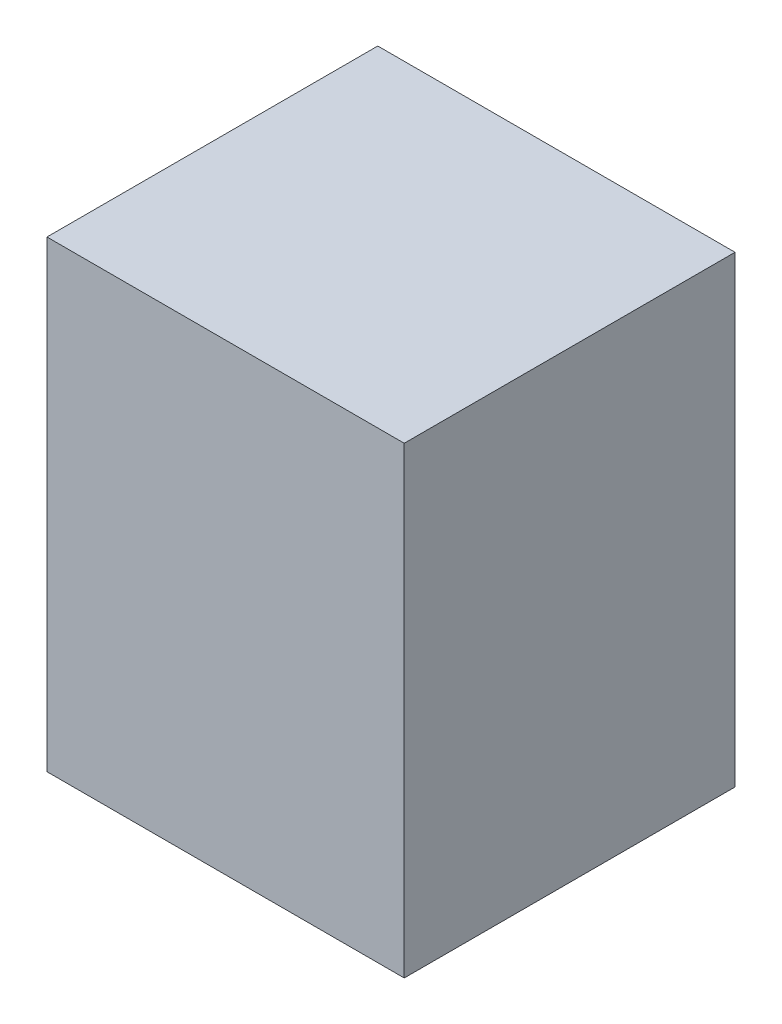
ISO-10303-21;
HEADER;
FILE_DESCRIPTION(('STEP AP214'),'2;1');
FILE_NAME('part.step','',(''),(''),'','','');
FILE_SCHEMA(('AUTOMOTIVE_DESIGN { 1 0 10303 214 1 1 1 1 }'));
ENDSEC;
DATA;
#1=APPLICATION_CONTEXT('core data for automotive mechanical design processes');
#2=APPLICATION_PROTOCOL_DEFINITION('international standard','automotive_design',2000,#1);
#3=PRODUCT_CONTEXT('',#1,'mechanical');
#4=PRODUCT('Part','Part','',(#3));
#5=PRODUCT_RELATED_PRODUCT_CATEGORY('part','',(#4));
#6=PRODUCT_DEFINITION_FORMATION('','',#4);
#7=PRODUCT_DEFINITION_CONTEXT('part definition',#1,'design');
#8=PRODUCT_DEFINITION('design','',#6,#7);
#9=PRODUCT_DEFINITION_SHAPE('','',#8);
#10=(LENGTH_UNIT() NAMED_UNIT(*) SI_UNIT(.MILLI.,.METRE.));
#11=(NAMED_UNIT(*) PLANE_ANGLE_UNIT() SI_UNIT($,.RADIAN.));
#12=(NAMED_UNIT(*) SI_UNIT($,.STERADIAN.) SOLID_ANGLE_UNIT());
#13=UNCERTAINTY_MEASURE_WITH_UNIT(LENGTH_MEASURE(1.E-05),#10,'distance_accuracy_value','');
#14=(GEOMETRIC_REPRESENTATION_CONTEXT(3) GLOBAL_UNCERTAINTY_ASSIGNED_CONTEXT((#13)) GLOBAL_UNIT_ASSIGNED_CONTEXT((#10,
#11,#12)) REPRESENTATION_CONTEXT('',''));
#15=CARTESIAN_POINT('',(0.,0.,0.));
#16=DIRECTION('',(0.,0.,1.));
#17=DIRECTION('',(1.,0.,0.));
#18=AXIS2_PLACEMENT_3D('',#15,#16,#17);
#19=CARTESIAN_POINT('',(1.34999984,1.75000158,2.50000008));
#20=DIRECTION('',(0.,0.,-1.));
#21=DIRECTION('',(-1.,0.,0.));
#22=AXIS2_PLACEMENT_3D('',#19,#20,#21);
#23=PLANE('',#22);
#24=DIRECTION('',(0.,1.,0.));
#25=VECTOR('',#24,1.);
#26=CARTESIAN_POINT('',(-1.34999984,1.75000158,2.50000008));
#27=LINE('',#26,#25);
#28=CARTESIAN_POINT('',(-1.34999984,1.75000158,2.50000008));
#29=VERTEX_POINT('',#28);
#30=CARTESIAN_POINT('',(-1.34999984,-1.74999904,2.50000008));
#31=VERTEX_POINT('',#30);
#32=EDGE_CURVE('E54',#29,#31,#27,.F.);
#33=ORIENTED_EDGE('',*,*,#32,.T.);
#34=DIRECTION('',(1.,0.,0.));
#35=VECTOR('',#34,1.);
#36=CARTESIAN_POINT('',(-1.34999984,-1.74999904,2.50000008));
#37=LINE('',#36,#35);
#38=CARTESIAN_POINT('',(1.34999984,-1.74999904,2.50000008));
#39=VERTEX_POINT('',#38);
#40=EDGE_CURVE('E56',#31,#39,#37,.T.);
#41=ORIENTED_EDGE('',*,*,#40,.T.);
#42=DIRECTION('',(0.,1.,0.));
#43=VECTOR('',#42,1.);
#44=CARTESIAN_POINT('',(1.34999984,-1.74999904,2.50000008));
#45=LINE('',#44,#43);
#46=CARTESIAN_POINT('',(1.34999984,1.75000158,2.50000008));
#47=VERTEX_POINT('',#46);
#48=EDGE_CURVE('E19',#39,#47,#45,.T.);
#49=ORIENTED_EDGE('',*,*,#48,.T.);
#50=DIRECTION('',(1.,0.,0.));
#51=VECTOR('',#50,1.);
#52=CARTESIAN_POINT('',(1.34999984,1.75000158,2.50000008));
#53=LINE('',#52,#51);
#54=EDGE_CURVE('E79',#47,#29,#53,.F.);
#55=ORIENTED_EDGE('',*,*,#54,.T.);
#56=EDGE_LOOP('',(#33,#41,#49,#55));
#57=FACE_BOUND('',#56,.T.);
#58=ADVANCED_FACE('F16',(#57),#23,.F.);
#59=CARTESIAN_POINT('',(1.34999984,-1.74999904,0.));
#60=DIRECTION('',(-1.,0.,0.));
#61=DIRECTION('',(0.,0.,1.));
#62=AXIS2_PLACEMENT_3D('',#59,#60,#61);
#63=PLANE('',#62);
#64=DIRECTION('',(0.,0.,-1.));
#65=VECTOR('',#64,1.);
#66=CARTESIAN_POINT('',(1.34999984,1.75000158,0.));
#67=LINE('',#66,#65);
#68=CARTESIAN_POINT('',(1.34999984,1.75000158,0.));
#69=VERTEX_POINT('',#68);
#70=EDGE_CURVE('E67',#69,#47,#67,.F.);
#71=ORIENTED_EDGE('',*,*,#70,.T.);
#72=ORIENTED_EDGE('',*,*,#48,.F.);
#73=DIRECTION('',(0.,0.,1.));
#74=VECTOR('',#73,1.);
#75=CARTESIAN_POINT('',(1.34999984,-1.74999904,0.));
#76=LINE('',#75,#74);
#77=CARTESIAN_POINT('',(1.34999984,-1.74999904,0.));
#78=VERTEX_POINT('',#77);
#79=EDGE_CURVE('E62',#39,#78,#76,.F.);
#80=ORIENTED_EDGE('',*,*,#79,.T.);
#81=DIRECTION('',(0.,1.,0.));
#82=VECTOR('',#81,1.);
#83=CARTESIAN_POINT('',(1.34999984,1.75000158,0.));
#84=LINE('',#83,#82);
#85=EDGE_CURVE('E82',#69,#78,#84,.F.);
#86=ORIENTED_EDGE('',*,*,#85,.F.);
#87=EDGE_LOOP('',(#71,#72,#80,#86));
#88=FACE_BOUND('',#87,.T.);
#89=ADVANCED_FACE('F64',(#88),#63,.F.);
#90=CARTESIAN_POINT('',(-1.34999984,-1.74999904,0.));
#91=DIRECTION('',(0.,1.,0.));
#92=DIRECTION('',(0.,0.,1.));
#93=AXIS2_PLACEMENT_3D('',#90,#91,#92);
#94=PLANE('',#93);
#95=ORIENTED_EDGE('',*,*,#79,.F.);
#96=ORIENTED_EDGE('',*,*,#40,.F.);
#97=DIRECTION('',(0.,0.,-1.));
#98=VECTOR('',#97,1.);
#99=CARTESIAN_POINT('',(-1.34999984,-1.74999904,0.));
#100=LINE('',#99,#98);
#101=CARTESIAN_POINT('',(-1.34999984,-1.74999904,0.));
#102=VERTEX_POINT('',#101);
#103=EDGE_CURVE('E74',#31,#102,#100,.T.);
#104=ORIENTED_EDGE('',*,*,#103,.T.);
#105=DIRECTION('',(-1.,0.,0.));
#106=VECTOR('',#105,1.);
#107=CARTESIAN_POINT('',(1.34999984,-1.74999904,0.));
#108=LINE('',#107,#106);
#109=EDGE_CURVE('E71',#78,#102,#108,.T.);
#110=ORIENTED_EDGE('',*,*,#109,.F.);
#111=EDGE_LOOP('',(#95,#96,#104,#110));
#112=FACE_BOUND('',#111,.T.);
#113=ADVANCED_FACE('F69',(#112),#94,.F.);
#114=CARTESIAN_POINT('',(-1.34999984,1.75000158,0.));
#115=DIRECTION('',(1.,0.,0.));
#116=DIRECTION('',(0.,0.,-1.));
#117=AXIS2_PLACEMENT_3D('',#114,#115,#116);
#118=PLANE('',#117);
#119=ORIENTED_EDGE('',*,*,#103,.F.);
#120=ORIENTED_EDGE('',*,*,#32,.F.);
#121=DIRECTION('',(0.,0.,-1.));
#122=VECTOR('',#121,1.);
#123=CARTESIAN_POINT('',(-1.34999984,1.75000158,0.));
#124=LINE('',#123,#122);
#125=CARTESIAN_POINT('',(-1.34999984,1.75000158,0.));
#126=VERTEX_POINT('',#125);
#127=EDGE_CURVE('E34',#29,#126,#124,.T.);
#128=ORIENTED_EDGE('',*,*,#127,.T.);
#129=DIRECTION('',(0.,1.,0.));
#130=VECTOR('',#129,1.);
#131=CARTESIAN_POINT('',(-1.34999984,1.75000158,0.));
#132=LINE('',#131,#130);
#133=EDGE_CURVE('E25',#102,#126,#132,.T.);
#134=ORIENTED_EDGE('',*,*,#133,.F.);
#135=EDGE_LOOP('',(#119,#120,#128,#134));
#136=FACE_BOUND('',#135,.T.);
#137=ADVANCED_FACE('F88',(#136),#118,.F.);
#138=CARTESIAN_POINT('',(1.34999984,1.75000158,0.));
#139=DIRECTION('',(0.,-1.,0.));
#140=DIRECTION('',(0.,0.,-1.));
#141=AXIS2_PLACEMENT_3D('',#138,#139,#140);
#142=PLANE('',#141);
#143=ORIENTED_EDGE('',*,*,#127,.F.);
#144=ORIENTED_EDGE('',*,*,#54,.F.);
#145=ORIENTED_EDGE('',*,*,#70,.F.);
#146=DIRECTION('',(-1.,0.,0.));
#147=VECTOR('',#146,1.);
#148=CARTESIAN_POINT('',(1.34999984,1.75000158,0.));
#149=LINE('',#148,#147);
#150=EDGE_CURVE('E11',#126,#69,#149,.F.);
#151=ORIENTED_EDGE('',*,*,#150,.F.);
#152=EDGE_LOOP('',(#143,#144,#145,#151));
#153=FACE_BOUND('',#152,.T.);
#154=ADVANCED_FACE('F90',(#153),#142,.F.);
#155=CARTESIAN_POINT('',(1.34999984,1.75000158,0.));
#156=DIRECTION('',(0.,0.,-1.));
#157=DIRECTION('',(-1.,0.,0.));
#158=AXIS2_PLACEMENT_3D('',#155,#156,#157);
#159=PLANE('',#158);
#160=ORIENTED_EDGE('',*,*,#133,.T.);
#161=ORIENTED_EDGE('',*,*,#150,.T.);
#162=ORIENTED_EDGE('',*,*,#85,.T.);
#163=ORIENTED_EDGE('',*,*,#109,.T.);
#164=EDGE_LOOP('',(#160,#161,#162,#163));
#165=FACE_BOUND('',#164,.T.);
#166=ADVANCED_FACE('F87',(#165),#159,.T.);
#167=CLOSED_SHELL('',(#58,#89,#113,#137,#154,#166));
#168=MANIFOLD_SOLID_BREP('B1',#167);
#169=ADVANCED_BREP_SHAPE_REPRESENTATION('',(#18,#168),#14);
#170=SHAPE_DEFINITION_REPRESENTATION(#9,#169);
ENDSEC;
END-ISO-10303-21;
